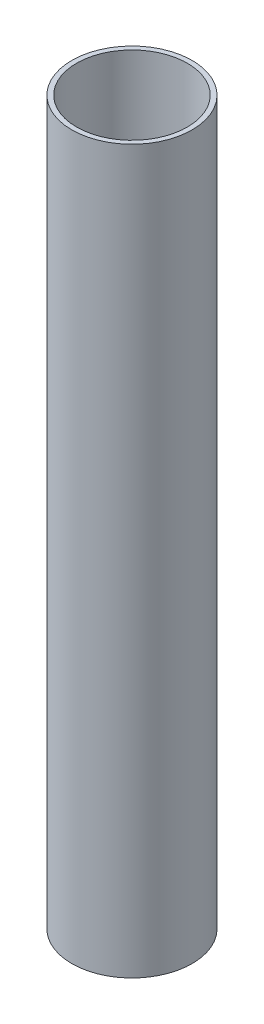
ISO-10303-21;
HEADER;
FILE_DESCRIPTION(('STEP AP214'),'2;1');
FILE_NAME('part.step','',(''),(''),'','','');
FILE_SCHEMA(('AUTOMOTIVE_DESIGN { 1 0 10303 214 1 1 1 1 }'));
ENDSEC;
DATA;
#1=APPLICATION_CONTEXT('core data for automotive mechanical design processes');
#2=APPLICATION_PROTOCOL_DEFINITION('international standard','automotive_design',2000,#1);
#3=PRODUCT_CONTEXT('',#1,'mechanical');
#4=PRODUCT('Part','Part','',(#3));
#5=PRODUCT_RELATED_PRODUCT_CATEGORY('part','',(#4));
#6=PRODUCT_DEFINITION_FORMATION('','',#4);
#7=PRODUCT_DEFINITION_CONTEXT('part definition',#1,'design');
#8=PRODUCT_DEFINITION('design','',#6,#7);
#9=PRODUCT_DEFINITION_SHAPE('','',#8);
#10=(LENGTH_UNIT() NAMED_UNIT(*) SI_UNIT(.MILLI.,.METRE.));
#11=(NAMED_UNIT(*) PLANE_ANGLE_UNIT() SI_UNIT($,.RADIAN.));
#12=(NAMED_UNIT(*) SI_UNIT($,.STERADIAN.) SOLID_ANGLE_UNIT());
#13=UNCERTAINTY_MEASURE_WITH_UNIT(LENGTH_MEASURE(1.E-05),#10,'distance_accuracy_value','');
#14=(GEOMETRIC_REPRESENTATION_CONTEXT(3) GLOBAL_UNCERTAINTY_ASSIGNED_CONTEXT((#13)) GLOBAL_UNIT_ASSIGNED_CONTEXT((#10,
#11,#12)) REPRESENTATION_CONTEXT('',''));
#15=CARTESIAN_POINT('',(0.,0.,0.));
#16=DIRECTION('',(0.,0.,1.));
#17=DIRECTION('',(1.,0.,0.));
#18=AXIS2_PLACEMENT_3D('',#15,#16,#17);
#19=CARTESIAN_POINT('',(0.,150.,0.));
#20=DIRECTION('',(0.,1.,0.));
#21=DIRECTION('',(0.,0.,1.));
#22=AXIS2_PLACEMENT_3D('',#19,#20,#21);
#23=PLANE('',#22);
#24=CARTESIAN_POINT('',(0.,150.,0.));
#25=DIRECTION('',(0.,1.,0.));
#26=DIRECTION('',(0.,0.,1.));
#27=AXIS2_PLACEMENT_3D('',#24,#25,#26);
#28=CIRCLE('',#27,12.5);
#29=CARTESIAN_POINT('',(0.,150.,12.5));
#30=VERTEX_POINT('',#29);
#31=EDGE_CURVE('E10',#30,#30,#28,.T.);
#32=ORIENTED_EDGE('',*,*,#31,.T.);
#33=EDGE_LOOP('',(#32));
#34=FACE_BOUND('',#33,.T.);
#35=CARTESIAN_POINT('',(0.,150.,0.));
#36=DIRECTION('',(0.,1.,0.));
#37=DIRECTION('',(0.,0.,1.));
#38=AXIS2_PLACEMENT_3D('',#35,#36,#37);
#39=CIRCLE('',#38,11.5);
#40=CARTESIAN_POINT('',(0.,150.,11.5));
#41=VERTEX_POINT('',#40);
#42=EDGE_CURVE('E44',#41,#41,#39,.T.);
#43=ORIENTED_EDGE('',*,*,#42,.F.);
#44=EDGE_LOOP('',(#43));
#45=FACE_BOUND('',#44,.T.);
#46=ADVANCED_FACE('F33',(#34,#45),#23,.T.);
#47=CARTESIAN_POINT('',(0.,0.,0.));
#48=DIRECTION('',(0.,1.,0.));
#49=DIRECTION('',(0.,0.,1.));
#50=AXIS2_PLACEMENT_3D('',#47,#48,#49);
#51=PLANE('',#50);
#52=CARTESIAN_POINT('',(0.,0.,0.));
#53=DIRECTION('',(0.,1.,0.));
#54=DIRECTION('',(0.,0.,1.));
#55=AXIS2_PLACEMENT_3D('',#52,#53,#54);
#56=CIRCLE('',#55,12.5);
#57=CARTESIAN_POINT('',(0.,0.,12.5));
#58=VERTEX_POINT('',#57);
#59=EDGE_CURVE('E37',#58,#58,#56,.T.);
#60=ORIENTED_EDGE('',*,*,#59,.F.);
#61=EDGE_LOOP('',(#60));
#62=FACE_BOUND('',#61,.T.);
#63=CARTESIAN_POINT('',(0.,0.,0.));
#64=DIRECTION('',(0.,1.,0.));
#65=DIRECTION('',(0.,0.,1.));
#66=AXIS2_PLACEMENT_3D('',#63,#64,#65);
#67=CIRCLE('',#66,11.5);
#68=CARTESIAN_POINT('',(0.,0.,11.5));
#69=VERTEX_POINT('',#68);
#70=EDGE_CURVE('E46',#69,#69,#67,.T.);
#71=ORIENTED_EDGE('',*,*,#70,.T.);
#72=EDGE_LOOP('',(#71));
#73=FACE_BOUND('',#72,.T.);
#74=ADVANCED_FACE('F56',(#62,#73),#51,.F.);
#75=CARTESIAN_POINT('',(0.,150.,0.));
#76=DIRECTION('',(0.,-1.,0.));
#77=DIRECTION('',(0.,0.,-1.));
#78=AXIS2_PLACEMENT_3D('',#75,#76,#77);
#79=CYLINDRICAL_SURFACE('',#78,12.5);
#80=ORIENTED_EDGE('',*,*,#31,.F.);
#81=EDGE_LOOP('',(#80));
#82=FACE_BOUND('',#81,.T.);
#83=ORIENTED_EDGE('',*,*,#59,.T.);
#84=EDGE_LOOP('',(#83));
#85=FACE_BOUND('',#84,.T.);
#86=ADVANCED_FACE('F35',(#82,#85),#79,.T.);
#87=CARTESIAN_POINT('',(0.,150.,0.));
#88=DIRECTION('',(0.,-1.,0.));
#89=DIRECTION('',(0.,0.,-1.));
#90=AXIS2_PLACEMENT_3D('',#87,#88,#89);
#91=CYLINDRICAL_SURFACE('',#90,11.5);
#92=ORIENTED_EDGE('',*,*,#42,.T.);
#93=EDGE_LOOP('',(#92));
#94=FACE_BOUND('',#93,.T.);
#95=ORIENTED_EDGE('',*,*,#70,.F.);
#96=EDGE_LOOP('',(#95));
#97=FACE_BOUND('',#96,.T.);
#98=ADVANCED_FACE('F52',(#94,#97),#91,.F.);
#99=CLOSED_SHELL('',(#46,#74,#86,#98));
#100=MANIFOLD_SOLID_BREP('B2',#99);
#101=ADVANCED_BREP_SHAPE_REPRESENTATION('',(#18,#100),#14);
#102=SHAPE_DEFINITION_REPRESENTATION(#9,#101);
ENDSEC;
END-ISO-10303-21;
